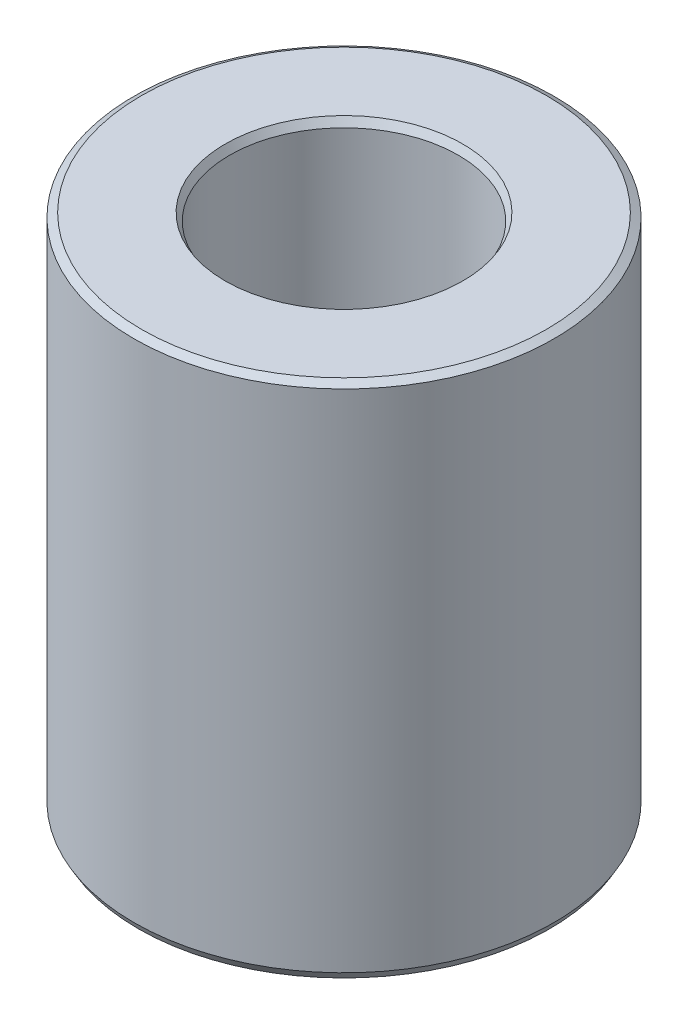
ISO-10303-21;
HEADER;
FILE_DESCRIPTION(('STEP AP214'),'2;1');
FILE_NAME('part.step','',(''),(''),'','','');
FILE_SCHEMA(('AUTOMOTIVE_DESIGN { 1 0 10303 214 1 1 1 1 }'));
ENDSEC;
DATA;
#1=APPLICATION_CONTEXT('core data for automotive mechanical design processes');
#2=APPLICATION_PROTOCOL_DEFINITION('international standard','automotive_design',2000,#1);
#3=PRODUCT_CONTEXT('',#1,'mechanical');
#4=PRODUCT('Part','Part','',(#3));
#5=PRODUCT_RELATED_PRODUCT_CATEGORY('part','',(#4));
#6=PRODUCT_DEFINITION_FORMATION('','',#4);
#7=PRODUCT_DEFINITION_CONTEXT('part definition',#1,'design');
#8=PRODUCT_DEFINITION('design','',#6,#7);
#9=PRODUCT_DEFINITION_SHAPE('','',#8);
#10=(LENGTH_UNIT() NAMED_UNIT(*) SI_UNIT(.MILLI.,.METRE.));
#11=(NAMED_UNIT(*) PLANE_ANGLE_UNIT() SI_UNIT($,.RADIAN.));
#12=(NAMED_UNIT(*) SI_UNIT($,.STERADIAN.) SOLID_ANGLE_UNIT());
#13=UNCERTAINTY_MEASURE_WITH_UNIT(LENGTH_MEASURE(1.E-05),#10,'distance_accuracy_value','');
#14=(GEOMETRIC_REPRESENTATION_CONTEXT(3) GLOBAL_UNCERTAINTY_ASSIGNED_CONTEXT((#13)) GLOBAL_UNIT_ASSIGNED_CONTEXT((#10,
#11,#12)) REPRESENTATION_CONTEXT('',''));
#15=CARTESIAN_POINT('',(0.,0.,0.));
#16=DIRECTION('',(0.,0.,1.));
#17=DIRECTION('',(1.,0.,0.));
#18=AXIS2_PLACEMENT_3D('',#15,#16,#17);
#19=CARTESIAN_POINT('',(0.,43.1105933319198,0.));
#20=DIRECTION('',(0.,-1.,0.));
#21=DIRECTION('',(0.,0.,-1.));
#22=AXIS2_PLACEMENT_3D('',#19,#20,#21);
#23=CYLINDRICAL_SURFACE('',#22,17.5);
#24=CARTESIAN_POINT('',(0.,0.630582235049151,0.));
#25=DIRECTION('',(0.,1.,0.));
#26=DIRECTION('',(0.,0.,1.));
#27=AXIS2_PLACEMENT_3D('',#24,#25,#26);
#28=CIRCLE('',#27,17.5);
#29=CARTESIAN_POINT('',(0.,0.630582235049151,17.5));
#30=VERTEX_POINT('',#29);
#31=EDGE_CURVE('E10',#30,#30,#28,.T.);
#32=ORIENTED_EDGE('',*,*,#31,.T.);
#33=EDGE_LOOP('',(#32));
#34=FACE_BOUND('',#33,.T.);
#35=CARTESIAN_POINT('',(0.,42.7491831290623,0.));
#36=DIRECTION('',(0.,1.,0.));
#37=DIRECTION('',(0.,0.,1.));
#38=AXIS2_PLACEMENT_3D('',#35,#36,#37);
#39=CIRCLE('',#38,17.5);
#40=CARTESIAN_POINT('',(0.,42.7491831290623,-17.5));
#41=VERTEX_POINT('',#40);
#42=EDGE_CURVE('E50',#41,#41,#39,.F.);
#43=ORIENTED_EDGE('',*,*,#42,.T.);
#44=EDGE_LOOP('',(#43));
#45=FACE_BOUND('',#44,.T.);
#46=ADVANCED_FACE('F39',(#34,#45),#23,.T.);
#47=CARTESIAN_POINT('',(0.,43.1105933319198,0.));
#48=DIRECTION('',(0.,1.,0.));
#49=DIRECTION('',(0.,0.,1.));
#50=AXIS2_PLACEMENT_3D('',#47,#48,#49);
#51=PLANE('',#50);
#52=CARTESIAN_POINT('',(0.,43.1105933319198,0.));
#53=DIRECTION('',(0.,1.,0.));
#54=DIRECTION('',(0.,0.,1.));
#55=AXIS2_PLACEMENT_3D('',#52,#53,#54);
#56=CIRCLE('',#55,9.89293142807478);
#57=CARTESIAN_POINT('',(0.,43.1105933319198,9.89293142807478));
#58=VERTEX_POINT('',#57);
#59=EDGE_CURVE('E58',#58,#58,#56,.F.);
#60=ORIENTED_EDGE('',*,*,#59,.T.);
#61=EDGE_LOOP('',(#60));
#62=FACE_BOUND('',#61,.T.);
#63=CARTESIAN_POINT('',(0.,43.1105933319198,0.));
#64=DIRECTION('',(0.,1.,0.));
#65=DIRECTION('',(0.,0.,1.));
#66=AXIS2_PLACEMENT_3D('',#63,#64,#65);
#67=CIRCLE('',#66,16.8694177649509);
#68=CARTESIAN_POINT('',(0.,43.1105933319198,-16.8694177649509));
#69=VERTEX_POINT('',#68);
#70=EDGE_CURVE('E61',#69,#69,#67,.T.);
#71=ORIENTED_EDGE('',*,*,#70,.T.);
#72=EDGE_LOOP('',(#71));
#73=FACE_BOUND('',#72,.T.);
#74=ADVANCED_FACE('F88',(#62,#73),#51,.T.);
#75=CARTESIAN_POINT('',(0.,0.,0.));
#76=DIRECTION('',(0.,1.,0.));
#77=DIRECTION('',(0.,0.,1.));
#78=AXIS2_PLACEMENT_3D('',#75,#76,#77);
#79=PLANE('',#78);
#80=CARTESIAN_POINT('',(0.,0.,0.));
#81=DIRECTION('',(0.,1.,0.));
#82=DIRECTION('',(0.,0.,1.));
#83=AXIS2_PLACEMENT_3D('',#80,#81,#82);
#84=CIRCLE('',#83,10.1621034602664);
#85=CARTESIAN_POINT('',(0.,0.,10.1621034602664));
#86=VERTEX_POINT('',#85);
#87=EDGE_CURVE('E51',#86,#86,#84,.T.);
#88=ORIENTED_EDGE('',*,*,#87,.T.);
#89=EDGE_LOOP('',(#88));
#90=FACE_BOUND('',#89,.T.);
#91=CARTESIAN_POINT('',(0.,0.,0.));
#92=DIRECTION('',(0.,1.,0.));
#93=DIRECTION('',(0.,0.,1.));
#94=AXIS2_PLACEMENT_3D('',#91,#92,#93);
#95=CIRCLE('',#94,17.1385897971425);
#96=CARTESIAN_POINT('',(0.,0.,17.1385897971425));
#97=VERTEX_POINT('',#96);
#98=EDGE_CURVE('E54',#97,#97,#95,.F.);
#99=ORIENTED_EDGE('',*,*,#98,.T.);
#100=EDGE_LOOP('',(#99));
#101=FACE_BOUND('',#100,.T.);
#102=ADVANCED_FACE('F83',(#90,#101),#79,.F.);
#103=CARTESIAN_POINT('',(0.,43.1105933319198,0.));
#104=DIRECTION('',(0.,-1.,0.));
#105=DIRECTION('',(0.,0.,-1.));
#106=AXIS2_PLACEMENT_3D('',#103,#104,#105);
#107=CYLINDRICAL_SURFACE('',#106,9.53152122521728);
#108=CARTESIAN_POINT('',(0.,42.4800110968707,0.));
#109=DIRECTION('',(0.,1.,0.));
#110=DIRECTION('',(0.,0.,1.));
#111=AXIS2_PLACEMENT_3D('',#108,#109,#110);
#112=CIRCLE('',#111,9.53152122521728);
#113=CARTESIAN_POINT('',(0.,42.4800110968707,9.53152122521728));
#114=VERTEX_POINT('',#113);
#115=EDGE_CURVE('E67',#114,#114,#112,.T.);
#116=ORIENTED_EDGE('',*,*,#115,.T.);
#117=EDGE_LOOP('',(#116));
#118=FACE_BOUND('',#117,.T.);
#119=CARTESIAN_POINT('',(0.,0.361410202857494,0.));
#120=DIRECTION('',(0.,1.,0.));
#121=DIRECTION('',(0.,0.,1.));
#122=AXIS2_PLACEMENT_3D('',#119,#120,#121);
#123=CIRCLE('',#122,9.53152122521728);
#124=CARTESIAN_POINT('',(0.,0.361410202857494,9.53152122521728));
#125=VERTEX_POINT('',#124);
#126=EDGE_CURVE('E69',#125,#125,#123,.F.);
#127=ORIENTED_EDGE('',*,*,#126,.T.);
#128=EDGE_LOOP('',(#127));
#129=FACE_BOUND('',#128,.T.);
#130=ADVANCED_FACE('F71',(#118,#129),#107,.F.);
#131=CARTESIAN_POINT('',(0.,42.4800110968707,0.));
#132=DIRECTION('',(0.,1.,0.));
#133=DIRECTION('',(0.,0.,1.));
#134=AXIS2_PLACEMENT_3D('',#131,#132,#133);
#135=CONICAL_SURFACE('',#134,9.53152122521728,0.520433288412046);
#136=ORIENTED_EDGE('',*,*,#59,.F.);
#137=EDGE_LOOP('',(#136));
#138=FACE_BOUND('',#137,.T.);
#139=ORIENTED_EDGE('',*,*,#115,.F.);
#140=EDGE_LOOP('',(#139));
#141=FACE_BOUND('',#140,.T.);
#142=ADVANCED_FACE('F77',(#138,#141),#135,.F.);
#143=CARTESIAN_POINT('',(0.,0.,0.));
#144=DIRECTION('',(0.,-1.,0.));
#145=DIRECTION('',(0.,0.,-1.));
#146=AXIS2_PLACEMENT_3D('',#143,#144,#145);
#147=CONICAL_SURFACE('',#146,10.1621034602664,1.05036303838286);
#148=ORIENTED_EDGE('',*,*,#126,.F.);
#149=EDGE_LOOP('',(#148));
#150=FACE_BOUND('',#149,.T.);
#151=ORIENTED_EDGE('',*,*,#87,.F.);
#152=EDGE_LOOP('',(#151));
#153=FACE_BOUND('',#152,.T.);
#154=ADVANCED_FACE('F73',(#150,#153),#147,.F.);
#155=CARTESIAN_POINT('',(0.,0.630582235049151,0.));
#156=DIRECTION('',(0.,1.,0.));
#157=DIRECTION('',(0.,0.,1.));
#158=AXIS2_PLACEMENT_3D('',#155,#156,#157);
#159=CONICAL_SURFACE('',#158,17.5,0.520433288412037);
#160=ORIENTED_EDGE('',*,*,#98,.F.);
#161=EDGE_LOOP('',(#160));
#162=FACE_BOUND('',#161,.T.);
#163=ORIENTED_EDGE('',*,*,#31,.F.);
#164=EDGE_LOOP('',(#163));
#165=FACE_BOUND('',#164,.T.);
#166=ADVANCED_FACE('F76',(#162,#165),#159,.T.);
#167=CARTESIAN_POINT('',(0.,43.1105933319198,0.));
#168=DIRECTION('',(0.,-1.,0.));
#169=DIRECTION('',(0.,0.,-1.));
#170=AXIS2_PLACEMENT_3D('',#167,#168,#169);
#171=CONICAL_SURFACE('',#170,16.8694177649509,1.05036303838286);
#172=CARTESIAN_POINT('',(0.,42.7491831290623,-17.5));
#173=CARTESIAN_POINT('',(0.,42.7529478186754,-17.4934314350516));
#174=CARTESIAN_POINT('',(0.,42.7567125082885,-17.4868628701032));
#175=CARTESIAN_POINT('',(0.,42.7642418875147,-17.4737257402063));
#176=CARTESIAN_POINT('',(0.,42.7680065771278,-17.4671571752579));
#177=CARTESIAN_POINT('',(0.,42.775535956354,-17.454020045361));
#178=CARTESIAN_POINT('',(0.,42.7793006459671,-17.4474514804126));
#179=CARTESIAN_POINT('',(0.,42.7868300251933,-17.4343143505157));
#180=CARTESIAN_POINT('',(0.,42.7905947148064,-17.4277457855673));
#181=CARTESIAN_POINT('',(0.,42.7981240940326,-17.4146086556704));
#182=CARTESIAN_POINT('',(0.,42.8018887836457,-17.408040090722));
#183=CARTESIAN_POINT('',(0.,42.8094181628719,-17.3949029608252));
#184=CARTESIAN_POINT('',(0.,42.813182852485,-17.3883343958767));
#185=CARTESIAN_POINT('',(0.,42.8207122317112,-17.3751972659799));
#186=CARTESIAN_POINT('',(0.,42.8244769213243,-17.3686287010314));
#187=CARTESIAN_POINT('',(0.,42.8320063005505,-17.3554915711346));
#188=CARTESIAN_POINT('',(0.,42.8357709901636,-17.3489230061862));
#189=CARTESIAN_POINT('',(0.,42.8433003693898,-17.3357858762893));
#190=CARTESIAN_POINT('',(0.,42.8470650590029,-17.3292173113409));
#191=CARTESIAN_POINT('',(0.,42.8545944382291,-17.316080181444));
#192=CARTESIAN_POINT('',(0.,42.8583591278422,-17.3095116164956));
#193=CARTESIAN_POINT('',(0.,42.8658885070684,-17.2963744865987));
#194=CARTESIAN_POINT('',(0.,42.8696531966815,-17.2898059216503));
#195=CARTESIAN_POINT('',(0.,42.8771825759077,-17.2766687917534));
#196=CARTESIAN_POINT('',(0.,42.8809472655208,-17.270100226805));
#197=CARTESIAN_POINT('',(0.,42.888476644747,-17.2569630969082));
#198=CARTESIAN_POINT('',(0.,42.8922413343601,-17.2503945319597));
#199=CARTESIAN_POINT('',(0.,42.8997707135863,-17.2372574020629));
#200=CARTESIAN_POINT('',(0.,42.9035354031994,-17.2306888371144));
#201=CARTESIAN_POINT('',(0.,42.9110647824256,-17.2175517072176));
#202=CARTESIAN_POINT('',(0.,42.9148294720387,-17.2109831422692));
#203=CARTESIAN_POINT('',(0.,42.9223588512649,-17.1978460123723));
#204=CARTESIAN_POINT('',(0.,42.926123540878,-17.1912774474239));
#205=CARTESIAN_POINT('',(0.,42.9336529201042,-17.178140317527));
#206=CARTESIAN_POINT('',(0.,42.9374176097173,-17.1715717525786));
#207=CARTESIAN_POINT('',(0.,42.9449469889435,-17.1584346226817));
#208=CARTESIAN_POINT('',(0.,42.9487116785566,-17.1518660577333));
#209=CARTESIAN_POINT('',(0.,42.9562410577828,-17.1387289278364));
#210=CARTESIAN_POINT('',(0.,42.9600057473959,-17.132160362888));
#211=CARTESIAN_POINT('',(0.,42.9675351266221,-17.1190232329912));
#212=CARTESIAN_POINT('',(0.,42.9712998162352,-17.1124546680427));
#213=CARTESIAN_POINT('',(0.,42.9788291954614,-17.0993175381459));
#214=CARTESIAN_POINT('',(0.,42.9825938850745,-17.0927489731974));
#215=CARTESIAN_POINT('',(0.,42.9901232643007,-17.0796118433006));
#216=CARTESIAN_POINT('',(0.,42.9938879539138,-17.0730432783522));
#217=CARTESIAN_POINT('',(0.,43.00141733314,-17.0599061484553));
#218=CARTESIAN_POINT('',(0.,43.0051820227531,-17.0533375835069));
#219=CARTESIAN_POINT('',(0.,43.0127114019793,-17.04020045361));
#220=CARTESIAN_POINT('',(0.,43.0164760915924,-17.0336318886616));
#221=CARTESIAN_POINT('',(0.,43.0240054708186,-17.0204947587647));
#222=CARTESIAN_POINT('',(0.,43.0277701604317,-17.0139261938163));
#223=CARTESIAN_POINT('',(0.,43.0352995396578,-17.0007890639194));
#224=CARTESIAN_POINT('',(0.,43.0390642292709,-16.994220498971));
#225=CARTESIAN_POINT('',(0.,43.0465936084971,-16.9810833690742));
#226=CARTESIAN_POINT('',(0.,43.0503582981102,-16.9745148041257));
#227=CARTESIAN_POINT('',(0.,43.0578876773364,-16.9613776742289));
#228=CARTESIAN_POINT('',(0.,43.0616523669495,-16.9548091092804));
#229=CARTESIAN_POINT('',(0.,43.0691817461757,-16.9416719793836));
#230=CARTESIAN_POINT('',(0.,43.0729464357888,-16.9351034144352));
#231=CARTESIAN_POINT('',(0.,43.080475815015,-16.9219662845383));
#232=CARTESIAN_POINT('',(0.,43.0842405046281,-16.9153977195899));
#233=CARTESIAN_POINT('',(0.,43.0917698838543,-16.902260589693));
#234=CARTESIAN_POINT('',(0.,43.0955345734674,-16.8956920247446));
#235=CARTESIAN_POINT('',(0.,43.1030639526936,-16.8825548948477));
#236=CARTESIAN_POINT('',(0.,43.1068286423067,-16.8759863298993));
#237=CARTESIAN_POINT('',(0.,43.1105933319198,-16.8694177649509));
#238=B_SPLINE_CURVE_WITH_KNOTS('',3,(#172,#173,#174,#175,#176,#177,#178,#179,#180,#181,#182,
#183,#184,#185,#186,#187,#188,#189,#190,#191,#192,#193,#194,#195,#196,#197,#198,#199,#200,#201,
#202,#203,#204,#205,#206,#207,#208,#209,#210,#211,#212,#213,#214,#215,#216,#217,#218,#219,#220,
#221,#222,#223,#224,#225,#226,#227,#228,#229,#230,#231,#232,#233,#234,#235,#236,#237),
.UNSPECIFIED.,.F.,.F.,(4,2,2,2,2,2,2,2,2,2,2,2,2,2,2,2,2,2,2,2,2,2,2,2,2,2,2,2,2,2,2,2,4),(0.,
0.0227127805493376,0.0454255610986722,0.0681383416480098,0.0908511221973444,0.113563902746682,
0.136276683296017,0.158989463845354,0.181702244394685,0.20441502494402,0.227127805493358,
0.249840586042692,0.27255336659203,0.295266147141364,0.317978927690702,0.340691708240037,
0.363404488789371,0.386117269338705,0.408830049888043,0.431542830437378,0.454255610986715,
0.47696839153605,0.499681172085388,0.522393952634722,0.54510673318406,0.567819513733391,
0.590532294282726,0.613245074832063,0.635957855381398,0.658670635930736,0.68138341648007,
0.704096197029408,0.726808977578743),.UNSPECIFIED.);
#239=EDGE_CURVE('BSEAM45',#41,#69,#238,.T.);
#240=ORIENTED_EDGE('',*,*,#42,.F.);
#241=ORIENTED_EDGE('',*,*,#70,.F.);
#242=ORIENTED_EDGE('',*,*,#239,.T.);
#243=ORIENTED_EDGE('',*,*,#239,.F.);
#244=EDGE_LOOP('',(#240,#242,#241,#243));
#245=FACE_BOUND('',#244,.T.);
#246=ADVANCED_FACE('F45',(#245),#171,.T.);
#247=CLOSED_SHELL('',(#46,#74,#102,#130,#142,#154,#166,#246));
#248=MANIFOLD_SOLID_BREP('B2',#247);
#249=ADVANCED_BREP_SHAPE_REPRESENTATION('',(#18,#248),#14);
#250=SHAPE_DEFINITION_REPRESENTATION(#9,#249);
ENDSEC;
END-ISO-10303-21;
